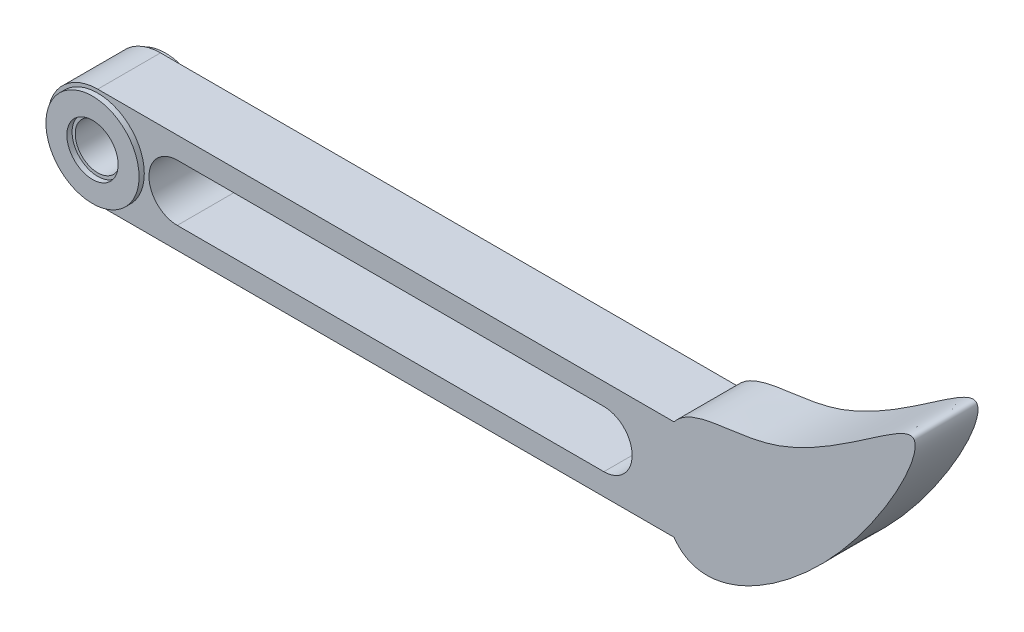
ISO-10303-21;
HEADER;
FILE_DESCRIPTION(('STEP AP214'),'2;1');
FILE_NAME('part.step','',(''),(''),'','','');
FILE_SCHEMA(('AUTOMOTIVE_DESIGN { 1 0 10303 214 1 1 1 1 }'));
ENDSEC;
DATA;
#1=APPLICATION_CONTEXT('core data for automotive mechanical design processes');
#2=APPLICATION_PROTOCOL_DEFINITION('international standard','automotive_design',2000,#1);
#3=PRODUCT_CONTEXT('',#1,'mechanical');
#4=PRODUCT('Part','Part','',(#3));
#5=PRODUCT_RELATED_PRODUCT_CATEGORY('part','',(#4));
#6=PRODUCT_DEFINITION_FORMATION('','',#4);
#7=PRODUCT_DEFINITION_CONTEXT('part definition',#1,'design');
#8=PRODUCT_DEFINITION('design','',#6,#7);
#9=PRODUCT_DEFINITION_SHAPE('','',#8);
#10=(LENGTH_UNIT() NAMED_UNIT(*) SI_UNIT(.MILLI.,.METRE.));
#11=(NAMED_UNIT(*) PLANE_ANGLE_UNIT() SI_UNIT($,.RADIAN.));
#12=(NAMED_UNIT(*) SI_UNIT($,.STERADIAN.) SOLID_ANGLE_UNIT());
#13=UNCERTAINTY_MEASURE_WITH_UNIT(LENGTH_MEASURE(1.E-05),#10,'distance_accuracy_value','');
#14=(GEOMETRIC_REPRESENTATION_CONTEXT(3) GLOBAL_UNCERTAINTY_ASSIGNED_CONTEXT((#13)) GLOBAL_UNIT_ASSIGNED_CONTEXT((#10,
#11,#12)) REPRESENTATION_CONTEXT('',''));
#15=CARTESIAN_POINT('',(0.,0.,0.));
#16=DIRECTION('',(0.,0.,1.));
#17=DIRECTION('',(1.,0.,0.));
#18=AXIS2_PLACEMENT_3D('',#15,#16,#17);
#19=CARTESIAN_POINT('',(25.0569113114217,4.7730330079918,2.99999999999998));
#20=DIRECTION('',(0.,-1.,0.));
#21=DIRECTION('',(0.,0.,-1.));
#22=AXIS2_PLACEMENT_3D('',#19,#20,#21);
#23=PLANE('',#22);
#24=DIRECTION('',(0.,0.,1.));
#25=VECTOR('',#24,1.);
#26=CARTESIAN_POINT('',(-30.,4.7730330079918,-7.00000000000001));
#27=LINE('',#26,#25);
#28=CARTESIAN_POINT('',(-30.,4.7730330079918,-3.));
#29=VERTEX_POINT('',#28);
#30=CARTESIAN_POINT('',(-30.,4.7730330079918,2.99999999999998));
#31=VERTEX_POINT('',#30);
#32=EDGE_CURVE('E67',#29,#31,#27,.T.);
#33=ORIENTED_EDGE('',*,*,#32,.T.);
#34=DIRECTION('',(-1.,0.,0.));
#35=VECTOR('',#34,1.);
#36=CARTESIAN_POINT('',(25.0569113114217,4.7730330079918,2.99999999999998));
#37=LINE('',#36,#35);
#38=CARTESIAN_POINT('',(25.0569113114217,4.7730330079918,2.99999999999998));
#39=VERTEX_POINT('',#38);
#40=EDGE_CURVE('E129',#39,#31,#37,.T.);
#41=ORIENTED_EDGE('',*,*,#40,.F.);
#42=DIRECTION('',(0.,0.,-1.));
#43=VECTOR('',#42,1.);
#44=CARTESIAN_POINT('',(25.0569113114217,4.7730330079918,2.99999999999998));
#45=LINE('',#44,#43);
#46=CARTESIAN_POINT('',(25.0569113114217,4.7730330079918,-3.00000000000002));
#47=VERTEX_POINT('',#46);
#48=EDGE_CURVE('E141',#39,#47,#45,.T.);
#49=ORIENTED_EDGE('',*,*,#48,.T.);
#50=DIRECTION('',(-1.,0.,0.));
#51=VECTOR('',#50,1.);
#52=CARTESIAN_POINT('',(25.0569113114217,4.7730330079918,-3.00000000000002));
#53=LINE('',#52,#51);
#54=EDGE_CURVE('E233',#47,#29,#53,.T.);
#55=ORIENTED_EDGE('',*,*,#54,.T.);
#56=EDGE_LOOP('',(#33,#41,#49,#55));
#57=FACE_BOUND('',#56,.T.);
#58=ADVANCED_FACE('F52',(#57),#23,.F.);
#59=CARTESIAN_POINT('',(-34.9430886885782,0.,-3.00000000000002));
#60=DIRECTION('',(0.,0.,1.));
#61=DIRECTION('',(1.,0.,0.));
#62=AXIS2_PLACEMENT_3D('',#59,#60,#61);
#63=PLANE('',#62);
#64=CARTESIAN_POINT('',(-30.,0.,-3.));
#65=DIRECTION('',(0.,0.,1.));
#66=DIRECTION('',(1.,0.,0.));
#67=AXIS2_PLACEMENT_3D('',#64,#65,#66);
#68=CIRCLE('',#67,2.15);
#69=CARTESIAN_POINT('',(-27.85,0.,-3.));
#70=VERTEX_POINT('',#69);
#71=EDGE_CURVE('E207',#70,#70,#68,.F.);
#72=ORIENTED_EDGE('',*,*,#71,.F.);
#73=EDGE_LOOP('',(#72));
#74=FACE_BOUND('',#73,.T.);
#75=CARTESIAN_POINT('',(-30.,0.,-3.));
#76=DIRECTION('',(0.,0.,-1.));
#77=DIRECTION('',(-1.,0.,0.));
#78=AXIS2_PLACEMENT_3D('',#75,#76,#77);
#79=CIRCLE('',#78,2.5);
#80=CARTESIAN_POINT('',(-32.5,0.,-3.));
#81=VERTEX_POINT('',#80);
#82=EDGE_CURVE('E173',#81,#81,#79,.T.);
#83=ORIENTED_EDGE('',*,*,#82,.T.);
#84=EDGE_LOOP('',(#83));
#85=FACE_BOUND('',#84,.T.);
#86=ADVANCED_FACE('F266',(#74,#85),#63,.F.);
#87=CARTESIAN_POINT('',(-34.9430886885782,0.,2.99999999999998));
#88=DIRECTION('',(0.,0.,1.));
#89=DIRECTION('',(1.,0.,0.));
#90=AXIS2_PLACEMENT_3D('',#87,#88,#89);
#91=PLANE('',#90);
#92=CARTESIAN_POINT('',(-30.,0.,2.99999999999999));
#93=DIRECTION('',(0.,0.,1.));
#94=DIRECTION('',(1.,0.,0.));
#95=AXIS2_PLACEMENT_3D('',#92,#93,#94);
#96=CIRCLE('',#95,2.15);
#97=CARTESIAN_POINT('',(-27.85,0.,2.99999999999999));
#98=VERTEX_POINT('',#97);
#99=EDGE_CURVE('E215',#98,#98,#96,.F.);
#100=ORIENTED_EDGE('',*,*,#99,.T.);
#101=EDGE_LOOP('',(#100));
#102=FACE_BOUND('',#101,.T.);
#103=CARTESIAN_POINT('',(-30.,0.,2.99999999999999));
#104=DIRECTION('',(0.,0.,1.));
#105=DIRECTION('',(1.,0.,0.));
#106=AXIS2_PLACEMENT_3D('',#103,#104,#105);
#107=CIRCLE('',#106,2.45);
#108=CARTESIAN_POINT('',(-27.55,0.,2.99999999999999));
#109=VERTEX_POINT('',#108);
#110=EDGE_CURVE('E191',#109,#109,#107,.F.);
#111=ORIENTED_EDGE('',*,*,#110,.F.);
#112=EDGE_LOOP('',(#111));
#113=FACE_BOUND('',#112,.T.);
#114=ADVANCED_FACE('F264',(#102,#113),#91,.T.);
#115=CARTESIAN_POINT('',(25.0569113114217,-4.77303300799178,2.99999999999998));
#116=DIRECTION('',(0.,1.,0.));
#117=DIRECTION('',(0.,0.,1.));
#118=AXIS2_PLACEMENT_3D('',#115,#116,#117);
#119=PLANE('',#118);
#120=DIRECTION('',(1.,0.,0.));
#121=VECTOR('',#120,1.);
#122=CARTESIAN_POINT('',(25.0569113114217,-4.77303300799178,2.99999999999998));
#123=LINE('',#122,#121);
#124=CARTESIAN_POINT('',(-30.,-4.77303300799178,3.));
#125=VERTEX_POINT('',#124);
#126=CARTESIAN_POINT('',(25.0569113114217,-4.77303300799178,2.99999999999998));
#127=VERTEX_POINT('',#126);
#128=EDGE_CURVE('E116',#125,#127,#123,.T.);
#129=ORIENTED_EDGE('',*,*,#128,.F.);
#130=DIRECTION('',(0.,0.,1.));
#131=VECTOR('',#130,1.);
#132=CARTESIAN_POINT('',(-30.,-4.77303300799178,-7.));
#133=LINE('',#132,#131);
#134=CARTESIAN_POINT('',(-30.,-4.7730330079918,-3.));
#135=VERTEX_POINT('',#134);
#136=EDGE_CURVE('E169',#135,#125,#133,.T.);
#137=ORIENTED_EDGE('',*,*,#136,.F.);
#138=DIRECTION('',(1.,0.,0.));
#139=VECTOR('',#138,1.);
#140=CARTESIAN_POINT('',(25.0569113114217,-4.77303300799178,-3.00000000000002));
#141=LINE('',#140,#139);
#142=CARTESIAN_POINT('',(25.0569113114217,-4.77303300799178,-3.00000000000002));
#143=VERTEX_POINT('',#142);
#144=EDGE_CURVE('E136',#135,#143,#141,.T.);
#145=ORIENTED_EDGE('',*,*,#144,.T.);
#146=DIRECTION('',(0.,0.,-1.));
#147=VECTOR('',#146,1.);
#148=CARTESIAN_POINT('',(25.0569113114217,-4.77303300799178,2.99999999999998));
#149=LINE('',#148,#147);
#150=EDGE_CURVE('E128',#127,#143,#149,.T.);
#151=ORIENTED_EDGE('',*,*,#150,.F.);
#152=EDGE_LOOP('',(#129,#137,#145,#151));
#153=FACE_BOUND('',#152,.T.);
#154=ADVANCED_FACE('F133',(#153),#119,.F.);
#155=ORIENTED_EDGE('',*,*,#128,.T.);
#156=CARTESIAN_POINT('',(25.0569113114217,-4.77303300799176,2.99999999999999));
#157=CARTESIAN_POINT('',(27.8152399464975,-8.73733334746298,2.99999999999999));
#158=CARTESIAN_POINT('',(41.5850702109259,-0.86409358202677,3.));
#159=CARTESIAN_POINT('',(52.8043579963191,21.6720770984066,2.99999999999998));
#160=CARTESIAN_POINT('',(36.4158755161116,5.49626828113062,3.));
#161=CARTESIAN_POINT('',(23.1584091554105,7.5863040495483,3.));
#162=CARTESIAN_POINT('',(23.452448801541,-2.46708179111864,2.99999999999999));
#163=CARTESIAN_POINT('',(25.0569113114217,-4.77303300799176,2.99999999999999));
#164=B_SPLINE_CURVE_WITH_KNOTS('',3,(#156,#157,#158,#159,#160,#161,#162,#163),.UNSPECIFIED.,.T.,
.F.,(4,1,1,1,1,4),(0.,0.246515533583638,0.480336101558722,0.712513075558114,0.856607031262132,
1.),.UNSPECIFIED.);
#165=EDGE_CURVE('E122',#127,#39,#164,.T.);
#166=ORIENTED_EDGE('',*,*,#165,.T.);
#167=ORIENTED_EDGE('',*,*,#40,.T.);
#168=CARTESIAN_POINT('',(-30.,0.,2.99999999999999));
#169=DIRECTION('',(0.,0.,-1.));
#170=DIRECTION('',(1.,0.,0.));
#171=AXIS2_PLACEMENT_3D('',#168,#169,#170);
#172=CIRCLE('',#171,4.77303300799179);
#173=EDGE_CURVE('E124',#125,#31,#172,.T.);
#174=ORIENTED_EDGE('',*,*,#173,.F.);
#175=EDGE_LOOP('',(#155,#166,#167,#174));
#176=FACE_BOUND('',#175,.T.);
#177=CARTESIAN_POINT('',(-30.,0.,2.99999999999999));
#178=DIRECTION('',(0.,0.,1.));
#179=DIRECTION('',(1.,0.,0.));
#180=AXIS2_PLACEMENT_3D('',#177,#178,#179);
#181=CIRCLE('',#180,4.45);
#182=CARTESIAN_POINT('',(-25.55,0.,2.99999999999999));
#183=VERTEX_POINT('',#182);
#184=EDGE_CURVE('E195',#183,#183,#181,.T.);
#185=ORIENTED_EDGE('',*,*,#184,.F.);
#186=EDGE_LOOP('',(#185));
#187=FACE_BOUND('',#186,.T.);
#188=DIRECTION('',(-1.,0.,0.));
#189=VECTOR('',#188,1.);
#190=CARTESIAN_POINT('',(-34.9430886885782,-2.69999999999998,2.99999999999998));
#191=LINE('',#190,#189);
#192=CARTESIAN_POINT('',(18.3569113114217,-2.69999999999997,3.));
#193=VERTEX_POINT('',#192);
#194=CARTESIAN_POINT('',(-22.401694851133,-2.69999999999998,3.));
#195=VERTEX_POINT('',#194);
#196=EDGE_CURVE('E227',#193,#195,#191,.T.);
#197=ORIENTED_EDGE('',*,*,#196,.T.);
#198=CARTESIAN_POINT('',(-22.401694851133,0.,3.));
#199=DIRECTION('',(0.,0.,1.));
#200=DIRECTION('',(1.,0.,0.));
#201=AXIS2_PLACEMENT_3D('',#198,#199,#200);
#202=CIRCLE('',#201,2.7);
#203=CARTESIAN_POINT('',(-22.4016948511331,2.70000000000001,3.));
#204=VERTEX_POINT('',#203);
#205=EDGE_CURVE('E106',#195,#204,#202,.F.);
#206=ORIENTED_EDGE('',*,*,#205,.T.);
#207=DIRECTION('',(1.,0.,0.));
#208=VECTOR('',#207,1.);
#209=CARTESIAN_POINT('',(-34.9430886885782,2.69999999999999,2.99999999999998));
#210=LINE('',#209,#208);
#211=CARTESIAN_POINT('',(18.3569113114217,2.70000000000004,3.));
#212=VERTEX_POINT('',#211);
#213=EDGE_CURVE('E219',#204,#212,#210,.T.);
#214=ORIENTED_EDGE('',*,*,#213,.T.);
#215=CARTESIAN_POINT('',(18.3569113114217,0.,3.));
#216=DIRECTION('',(0.,0.,1.));
#217=DIRECTION('',(1.,0.,0.));
#218=AXIS2_PLACEMENT_3D('',#215,#216,#217);
#219=CIRCLE('',#218,2.7);
#220=EDGE_CURVE('E223',#212,#193,#219,.F.);
#221=ORIENTED_EDGE('',*,*,#220,.T.);
#222=EDGE_LOOP('',(#197,#206,#214,#221));
#223=FACE_BOUND('',#222,.T.);
#224=ADVANCED_FACE('F118',(#176,#187,#223),#91,.T.);
#225=CARTESIAN_POINT('',(-30.,0.,-3.));
#226=DIRECTION('',(0.,0.,-1.));
#227=DIRECTION('',(-1.,0.,0.));
#228=AXIS2_PLACEMENT_3D('',#225,#226,#227);
#229=CIRCLE('',#228,4.5);
#230=CARTESIAN_POINT('',(-34.5,0.,-3.));
#231=VERTEX_POINT('',#230);
#232=EDGE_CURVE('E60',#231,#231,#229,.T.);
#233=ORIENTED_EDGE('',*,*,#232,.F.);
#234=EDGE_LOOP('',(#233));
#235=FACE_BOUND('',#234,.T.);
#236=CARTESIAN_POINT('',(-22.4016948511331,0.,-3.));
#237=DIRECTION('',(0.,0.,-1.));
#238=DIRECTION('',(-1.,0.,0.));
#239=AXIS2_PLACEMENT_3D('',#236,#237,#238);
#240=CIRCLE('',#239,2.7);
#241=CARTESIAN_POINT('',(-22.4016948511331,-2.69999999999998,-3.));
#242=VERTEX_POINT('',#241);
#243=CARTESIAN_POINT('',(-22.4016948511331,2.70000000000001,-3.));
#244=VERTEX_POINT('',#243);
#245=EDGE_CURVE('E254',#242,#244,#240,.T.);
#246=ORIENTED_EDGE('',*,*,#245,.F.);
#247=DIRECTION('',(-1.,0.,0.));
#248=VECTOR('',#247,1.);
#249=CARTESIAN_POINT('',(-22.4016948511331,-2.69999999999998,-3.));
#250=LINE('',#249,#248);
#251=CARTESIAN_POINT('',(18.3569113114217,-2.69999999999997,-3.));
#252=VERTEX_POINT('',#251);
#253=EDGE_CURVE('E97',#252,#242,#250,.T.);
#254=ORIENTED_EDGE('',*,*,#253,.F.);
#255=CARTESIAN_POINT('',(18.3569113114217,0.,-3.));
#256=DIRECTION('',(0.,0.,-1.));
#257=DIRECTION('',(-1.,0.,0.));
#258=AXIS2_PLACEMENT_3D('',#255,#256,#257);
#259=CIRCLE('',#258,2.7);
#260=CARTESIAN_POINT('',(18.3569113114217,2.70000000000002,-3.));
#261=VERTEX_POINT('',#260);
#262=EDGE_CURVE('E249',#261,#252,#259,.T.);
#263=ORIENTED_EDGE('',*,*,#262,.F.);
#264=DIRECTION('',(1.,0.,0.));
#265=VECTOR('',#264,1.);
#266=CARTESIAN_POINT('',(-22.4016948511331,2.70000000000001,-3.));
#267=LINE('',#266,#265);
#268=EDGE_CURVE('E243',#244,#261,#267,.T.);
#269=ORIENTED_EDGE('',*,*,#268,.F.);
#270=EDGE_LOOP('',(#246,#254,#263,#269));
#271=FACE_BOUND('',#270,.T.);
#272=ORIENTED_EDGE('',*,*,#54,.F.);
#273=CARTESIAN_POINT('',(25.0569113114217,-4.77303300799176,-3.00000000000002));
#274=CARTESIAN_POINT('',(27.8152399464975,-8.73733334746298,-3.00000000000002));
#275=CARTESIAN_POINT('',(41.5850702109259,-0.86409358202677,-3.));
#276=CARTESIAN_POINT('',(52.8043579963191,21.6720770984066,-3.00000000000002));
#277=CARTESIAN_POINT('',(36.4158755161116,5.49626828113062,-3.));
#278=CARTESIAN_POINT('',(23.1584091554104,7.58630404954828,-3.));
#279=CARTESIAN_POINT('',(23.452448801541,-2.46708179111865,-3.00000000000001));
#280=CARTESIAN_POINT('',(25.0569113114217,-4.77303300799176,-3.00000000000002));
#281=B_SPLINE_CURVE_WITH_KNOTS('',3,(#273,#274,#275,#276,#277,#278,#279,#280),.UNSPECIFIED.,.T.,
.F.,(4,1,1,1,1,4),(0.,0.246515533583638,0.480336101558722,0.712513075558114,0.856607031262132,
1.),.UNSPECIFIED.);
#282=EDGE_CURVE('E147',#47,#143,#281,.F.);
#283=ORIENTED_EDGE('',*,*,#282,.T.);
#284=ORIENTED_EDGE('',*,*,#144,.F.);
#285=CARTESIAN_POINT('',(-30.,0.,-3.));
#286=DIRECTION('',(0.,0.,1.));
#287=DIRECTION('',(1.,0.,0.));
#288=AXIS2_PLACEMENT_3D('',#285,#286,#287);
#289=CIRCLE('',#288,4.77303300799179);
#290=EDGE_CURVE('E12',#135,#29,#289,.F.);
#291=ORIENTED_EDGE('',*,*,#290,.T.);
#292=EDGE_LOOP('',(#272,#283,#284,#291));
#293=FACE_BOUND('',#292,.T.);
#294=ADVANCED_FACE('F275',(#235,#271,#293),#63,.F.);
#295=CARTESIAN_POINT('',(-30.,0.,6.99999999999999));
#296=DIRECTION('',(0.,0.,-1.));
#297=DIRECTION('',(-1.,0.,0.));
#298=AXIS2_PLACEMENT_3D('',#295,#296,#297);
#299=CYLINDRICAL_SURFACE('',#298,2.15);
#300=ORIENTED_EDGE('',*,*,#99,.F.);
#301=EDGE_LOOP('',(#300));
#302=FACE_BOUND('',#301,.T.);
#303=ORIENTED_EDGE('',*,*,#71,.T.);
#304=EDGE_LOOP('',(#303));
#305=FACE_BOUND('',#304,.T.);
#306=ADVANCED_FACE('F302',(#302,#305),#299,.F.);
#307=CARTESIAN_POINT('',(-22.4016948511331,0.,7.));
#308=DIRECTION('',(0.,0.,-1.));
#309=DIRECTION('',(-1.,0.,0.));
#310=AXIS2_PLACEMENT_3D('',#307,#308,#309);
#311=CYLINDRICAL_SURFACE('',#310,2.7);
#312=DIRECTION('',(0.,0.,-1.));
#313=VECTOR('',#312,1.);
#314=CARTESIAN_POINT('',(-22.4016948511331,-2.69999999999998,7.));
#315=LINE('',#314,#313);
#316=EDGE_CURVE('E204',#195,#242,#315,.T.);
#317=ORIENTED_EDGE('',*,*,#316,.T.);
#318=ORIENTED_EDGE('',*,*,#245,.T.);
#319=DIRECTION('',(0.,0.,-1.));
#320=VECTOR('',#319,1.);
#321=CARTESIAN_POINT('',(-22.4016948511331,2.70000000000001,7.));
#322=LINE('',#321,#320);
#323=EDGE_CURVE('E200',#204,#244,#322,.T.);
#324=ORIENTED_EDGE('',*,*,#323,.F.);
#325=ORIENTED_EDGE('',*,*,#205,.F.);
#326=EDGE_LOOP('',(#317,#318,#324,#325));
#327=FACE_BOUND('',#326,.T.);
#328=ADVANCED_FACE('F290',(#327),#311,.F.);
#329=CARTESIAN_POINT('',(-22.4016948511331,-2.69999999999998,7.));
#330=DIRECTION('',(0.,1.,0.));
#331=DIRECTION('',(-1.,0.,0.));
#332=AXIS2_PLACEMENT_3D('',#329,#330,#331);
#333=PLANE('',#332);
#334=DIRECTION('',(0.,0.,-1.));
#335=VECTOR('',#334,1.);
#336=CARTESIAN_POINT('',(18.3569113114217,-2.69999999999997,7.));
#337=LINE('',#336,#335);
#338=EDGE_CURVE('E208',#193,#252,#337,.T.);
#339=ORIENTED_EDGE('',*,*,#338,.T.);
#340=ORIENTED_EDGE('',*,*,#253,.T.);
#341=ORIENTED_EDGE('',*,*,#316,.F.);
#342=ORIENTED_EDGE('',*,*,#196,.F.);
#343=EDGE_LOOP('',(#339,#340,#341,#342));
#344=FACE_BOUND('',#343,.T.);
#345=ADVANCED_FACE('F295',(#344),#333,.T.);
#346=CARTESIAN_POINT('',(18.3569113114217,0.,7.));
#347=DIRECTION('',(0.,0.,-1.));
#348=DIRECTION('',(-1.,0.,0.));
#349=AXIS2_PLACEMENT_3D('',#346,#347,#348);
#350=CYLINDRICAL_SURFACE('',#349,2.7);
#351=DIRECTION('',(0.,0.,-1.));
#352=VECTOR('',#351,1.);
#353=CARTESIAN_POINT('',(18.3569113114217,2.70000000000004,7.));
#354=LINE('',#353,#352);
#355=EDGE_CURVE('E75',#212,#261,#354,.T.);
#356=ORIENTED_EDGE('',*,*,#355,.T.);
#357=ORIENTED_EDGE('',*,*,#262,.T.);
#358=ORIENTED_EDGE('',*,*,#338,.F.);
#359=ORIENTED_EDGE('',*,*,#220,.F.);
#360=EDGE_LOOP('',(#356,#357,#358,#359));
#361=FACE_BOUND('',#360,.T.);
#362=ADVANCED_FACE('F297',(#361),#350,.F.);
#363=CARTESIAN_POINT('',(-22.4016948511331,2.70000000000001,7.));
#364=DIRECTION('',(0.,-1.,0.));
#365=DIRECTION('',(1.,0.,0.));
#366=AXIS2_PLACEMENT_3D('',#363,#364,#365);
#367=PLANE('',#366);
#368=ORIENTED_EDGE('',*,*,#323,.T.);
#369=ORIENTED_EDGE('',*,*,#268,.T.);
#370=ORIENTED_EDGE('',*,*,#355,.F.);
#371=ORIENTED_EDGE('',*,*,#213,.F.);
#372=EDGE_LOOP('',(#368,#369,#370,#371));
#373=FACE_BOUND('',#372,.T.);
#374=ADVANCED_FACE('F288',(#373),#367,.T.);
#375=CARTESIAN_POINT('',(-30.,0.,3.49999999999999));
#376=DIRECTION('',(0.,0.,1.));
#377=DIRECTION('',(1.,0.,0.));
#378=AXIS2_PLACEMENT_3D('',#375,#376,#377);
#379=PLANE('',#378);
#380=CARTESIAN_POINT('',(-30.,0.,3.49999999999999));
#381=DIRECTION('',(0.,0.,1.));
#382=DIRECTION('',(1.,0.,0.));
#383=AXIS2_PLACEMENT_3D('',#380,#381,#382);
#384=CIRCLE('',#383,4.45);
#385=CARTESIAN_POINT('',(-25.55,0.,3.49999999999999));
#386=VERTEX_POINT('',#385);
#387=EDGE_CURVE('E196',#386,#386,#384,.T.);
#388=ORIENTED_EDGE('',*,*,#387,.T.);
#389=EDGE_LOOP('',(#388));
#390=FACE_BOUND('',#389,.T.);
#391=CARTESIAN_POINT('',(-30.,0.,3.49999999999999));
#392=DIRECTION('',(0.,0.,1.));
#393=DIRECTION('',(1.,0.,0.));
#394=AXIS2_PLACEMENT_3D('',#391,#392,#393);
#395=CIRCLE('',#394,2.45);
#396=CARTESIAN_POINT('',(-27.55,0.,3.49999999999999));
#397=VERTEX_POINT('',#396);
#398=EDGE_CURVE('E187',#397,#397,#395,.T.);
#399=ORIENTED_EDGE('',*,*,#398,.F.);
#400=EDGE_LOOP('',(#399));
#401=FACE_BOUND('',#400,.T.);
#402=ADVANCED_FACE('F328',(#390,#401),#379,.T.);
#403=CARTESIAN_POINT('',(-30.,0.,3.49999999999999));
#404=DIRECTION('',(0.,0.,-1.));
#405=DIRECTION('',(-1.,0.,0.));
#406=AXIS2_PLACEMENT_3D('',#403,#404,#405);
#407=CYLINDRICAL_SURFACE('',#406,4.45);
#408=ORIENTED_EDGE('',*,*,#387,.F.);
#409=EDGE_LOOP('',(#408));
#410=FACE_BOUND('',#409,.T.);
#411=ORIENTED_EDGE('',*,*,#184,.T.);
#412=EDGE_LOOP('',(#411));
#413=FACE_BOUND('',#412,.T.);
#414=ADVANCED_FACE('F326',(#410,#413),#407,.T.);
#415=CARTESIAN_POINT('',(-30.,0.,3.49999999999999));
#416=DIRECTION('',(0.,0.,-1.));
#417=DIRECTION('',(-1.,0.,0.));
#418=AXIS2_PLACEMENT_3D('',#415,#416,#417);
#419=CYLINDRICAL_SURFACE('',#418,2.45);
#420=ORIENTED_EDGE('',*,*,#398,.T.);
#421=EDGE_LOOP('',(#420));
#422=FACE_BOUND('',#421,.T.);
#423=ORIENTED_EDGE('',*,*,#110,.T.);
#424=EDGE_LOOP('',(#423));
#425=FACE_BOUND('',#424,.T.);
#426=ADVANCED_FACE('F262',(#422,#425),#419,.F.);
#427=CARTESIAN_POINT('',(-30.,0.,-3.5));
#428=DIRECTION('',(0.,0.,-1.));
#429=DIRECTION('',(-1.,0.,0.));
#430=AXIS2_PLACEMENT_3D('',#427,#428,#429);
#431=PLANE('',#430);
#432=CARTESIAN_POINT('',(-30.,0.,-3.5));
#433=DIRECTION('',(0.,0.,-1.));
#434=DIRECTION('',(-1.,0.,0.));
#435=AXIS2_PLACEMENT_3D('',#432,#433,#434);
#436=CIRCLE('',#435,4.5);
#437=CARTESIAN_POINT('',(-34.5,0.,-3.5));
#438=VERTEX_POINT('',#437);
#439=EDGE_CURVE('E180',#438,#438,#436,.T.);
#440=ORIENTED_EDGE('',*,*,#439,.T.);
#441=EDGE_LOOP('',(#440));
#442=FACE_BOUND('',#441,.T.);
#443=CARTESIAN_POINT('',(-30.,0.,-3.5));
#444=DIRECTION('',(0.,0.,-1.));
#445=DIRECTION('',(-1.,0.,0.));
#446=AXIS2_PLACEMENT_3D('',#443,#444,#445);
#447=CIRCLE('',#446,2.5);
#448=CARTESIAN_POINT('',(-32.5,0.,-3.5));
#449=VERTEX_POINT('',#448);
#450=EDGE_CURVE('E176',#449,#449,#447,.T.);
#451=ORIENTED_EDGE('',*,*,#450,.F.);
#452=EDGE_LOOP('',(#451));
#453=FACE_BOUND('',#452,.T.);
#454=ADVANCED_FACE('F317',(#442,#453),#431,.T.);
#455=CARTESIAN_POINT('',(-30.,0.,-3.5));
#456=DIRECTION('',(0.,0.,1.));
#457=DIRECTION('',(1.,0.,0.));
#458=AXIS2_PLACEMENT_3D('',#455,#456,#457);
#459=CYLINDRICAL_SURFACE('',#458,4.5);
#460=ORIENTED_EDGE('',*,*,#439,.F.);
#461=EDGE_LOOP('',(#460));
#462=FACE_BOUND('',#461,.T.);
#463=ORIENTED_EDGE('',*,*,#232,.T.);
#464=EDGE_LOOP('',(#463));
#465=FACE_BOUND('',#464,.T.);
#466=ADVANCED_FACE('F313',(#462,#465),#459,.T.);
#467=CARTESIAN_POINT('',(-30.,0.,-3.5));
#468=DIRECTION('',(0.,0.,1.));
#469=DIRECTION('',(1.,0.,0.));
#470=AXIS2_PLACEMENT_3D('',#467,#468,#469);
#471=CYLINDRICAL_SURFACE('',#470,2.5);
#472=ORIENTED_EDGE('',*,*,#450,.T.);
#473=EDGE_LOOP('',(#472));
#474=FACE_BOUND('',#473,.T.);
#475=ORIENTED_EDGE('',*,*,#82,.F.);
#476=EDGE_LOOP('',(#475));
#477=FACE_BOUND('',#476,.T.);
#478=ADVANCED_FACE('F306',(#474,#477),#471,.F.);
#479=CARTESIAN_POINT('',(-30.,0.,-7.00000000000001));
#480=DIRECTION('',(0.,0.,1.));
#481=DIRECTION('',(1.,0.,0.));
#482=AXIS2_PLACEMENT_3D('',#479,#480,#481);
#483=CYLINDRICAL_SURFACE('',#482,4.77303300799179);
#484=ORIENTED_EDGE('',*,*,#136,.T.);
#485=ORIENTED_EDGE('',*,*,#173,.T.);
#486=ORIENTED_EDGE('',*,*,#32,.F.);
#487=ORIENTED_EDGE('',*,*,#290,.F.);
#488=EDGE_LOOP('',(#484,#485,#486,#487));
#489=FACE_BOUND('',#488,.T.);
#490=ADVANCED_FACE('F304',(#489),#483,.T.);
#491=CARTESIAN_POINT('',(25.0569113114217,-4.77303300799176,-36.0462277439474));
#492=CARTESIAN_POINT('',(27.8152399464975,-8.73733334746298,-36.0462277439474));
#493=CARTESIAN_POINT('',(41.5850702109259,-0.86409358202677,-36.0462277439474));
#494=CARTESIAN_POINT('',(52.8043579963191,21.6720770984066,-36.0462277439474));
#495=CARTESIAN_POINT('',(36.4158755161116,5.49626828113062,-36.0462277439474));
#496=CARTESIAN_POINT('',(23.1584091554105,7.5863040495483,-36.0462277439474));
#497=CARTESIAN_POINT('',(23.452448801541,-2.46708179111864,-36.0462277439474));
#498=CARTESIAN_POINT('',(25.0569113114217,-4.77303300799176,-36.0462277439474));
#499=B_SPLINE_CURVE_WITH_KNOTS('',3,(#491,#492,#493,#494,#495,#496,#497,#498),.UNSPECIFIED.,.T.,
.F.,(4,1,1,1,1,4),(0.,0.246515533583638,0.480336101558722,0.712513075558114,0.856607031262132,
1.),.UNSPECIFIED.);
#500=DIRECTION('',(0.,0.,1.));
#501=VECTOR('',#500,1.);
#502=SURFACE_OF_LINEAR_EXTRUSION('',#499,#501);
#503=ORIENTED_EDGE('',*,*,#48,.F.);
#504=ORIENTED_EDGE('',*,*,#165,.F.);
#505=ORIENTED_EDGE('',*,*,#150,.T.);
#506=ORIENTED_EDGE('',*,*,#282,.F.);
#507=EDGE_LOOP('',(#503,#504,#505,#506));
#508=FACE_BOUND('',#507,.T.);
#509=ADVANCED_FACE('F144',(#508),#502,.T.);
#510=CLOSED_SHELL('',(#58,#86,#114,#154,#224,#294,#306,#328,#345,#362,#374,#402,#414,#426,#454,
#466,#478,#490,#509));
#511=MANIFOLD_SOLID_BREP('B2',#510);
#512=ADVANCED_BREP_SHAPE_REPRESENTATION('',(#18,#511),#14);
#513=SHAPE_DEFINITION_REPRESENTATION(#9,#512);
ENDSEC;
END-ISO-10303-21;
